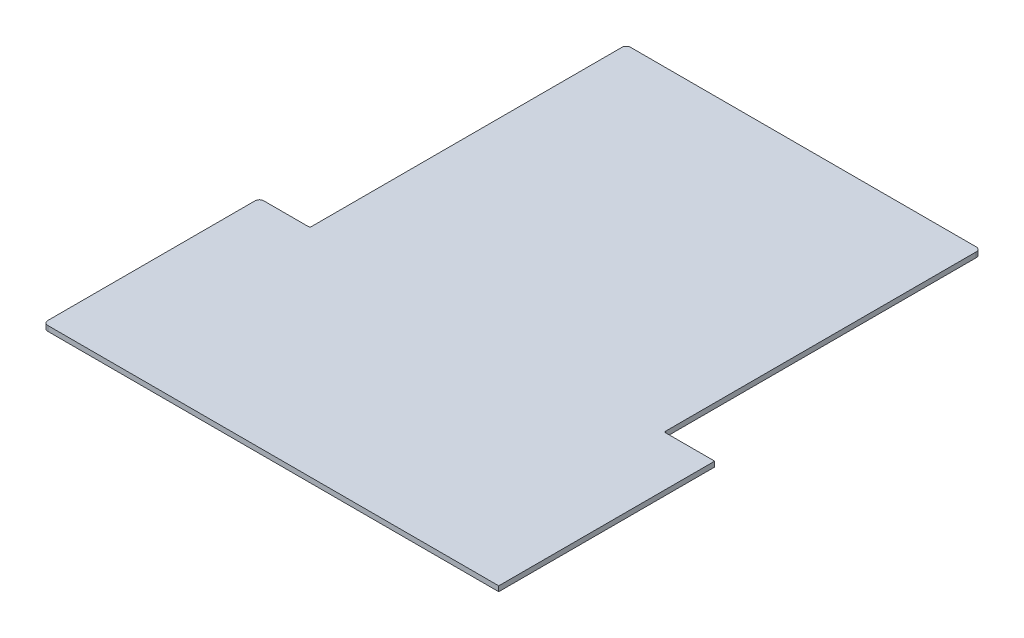
ISO-10303-21;
HEADER;
FILE_DESCRIPTION(('STEP AP214'),'2;1');
FILE_NAME('part.step','',(''),(''),'','','');
FILE_SCHEMA(('AUTOMOTIVE_DESIGN { 1 0 10303 214 1 1 1 1 }'));
ENDSEC;
DATA;
#1=APPLICATION_CONTEXT('core data for automotive mechanical design processes');
#2=APPLICATION_PROTOCOL_DEFINITION('international standard','automotive_design',2000,#1);
#3=PRODUCT_CONTEXT('',#1,'mechanical');
#4=PRODUCT('Part','Part','',(#3));
#5=PRODUCT_RELATED_PRODUCT_CATEGORY('part','',(#4));
#6=PRODUCT_DEFINITION_FORMATION('','',#4);
#7=PRODUCT_DEFINITION_CONTEXT('part definition',#1,'design');
#8=PRODUCT_DEFINITION('design','',#6,#7);
#9=PRODUCT_DEFINITION_SHAPE('','',#8);
#10=(LENGTH_UNIT() NAMED_UNIT(*) SI_UNIT(.MILLI.,.METRE.));
#11=(NAMED_UNIT(*) PLANE_ANGLE_UNIT() SI_UNIT($,.RADIAN.));
#12=(NAMED_UNIT(*) SI_UNIT($,.STERADIAN.) SOLID_ANGLE_UNIT());
#13=UNCERTAINTY_MEASURE_WITH_UNIT(LENGTH_MEASURE(1.E-05),#10,'distance_accuracy_value','');
#14=(GEOMETRIC_REPRESENTATION_CONTEXT(3) GLOBAL_UNCERTAINTY_ASSIGNED_CONTEXT((#13)) GLOBAL_UNIT_ASSIGNED_CONTEXT((#10,
#11,#12)) REPRESENTATION_CONTEXT('',''));
#15=CARTESIAN_POINT('',(0.,0.,0.));
#16=DIRECTION('',(0.,0.,1.));
#17=DIRECTION('',(1.,0.,0.));
#18=AXIS2_PLACEMENT_3D('',#15,#16,#17);
#19=CARTESIAN_POINT('',(-103.5,3.,-155.5));
#20=DIRECTION('',(0.,0.,1.));
#21=DIRECTION('',(1.,0.,0.));
#22=AXIS2_PLACEMENT_3D('',#19,#20,#21);
#23=PLANE('',#22);
#24=DIRECTION('',(-1.,0.,0.));
#25=VECTOR('',#24,1.);
#26=CARTESIAN_POINT('',(-103.5,0.,-155.5));
#27=LINE('',#26,#25);
#28=CARTESIAN_POINT('',(101.,0.,-155.5));
#29=VERTEX_POINT('',#28);
#30=CARTESIAN_POINT('',(-101.,0.,-155.5));
#31=VERTEX_POINT('',#30);
#32=EDGE_CURVE('E172',#29,#31,#27,.T.);
#33=ORIENTED_EDGE('',*,*,#32,.T.);
#34=DIRECTION('',(0.,-1.,0.));
#35=VECTOR('',#34,1.);
#36=CARTESIAN_POINT('',(-101.,3.,-155.5));
#37=LINE('',#36,#35);
#38=CARTESIAN_POINT('',(-101.,3.,-155.5));
#39=VERTEX_POINT('',#38);
#40=EDGE_CURVE('E224',#31,#39,#37,.F.);
#41=ORIENTED_EDGE('',*,*,#40,.T.);
#42=DIRECTION('',(-1.,0.,0.));
#43=VECTOR('',#42,1.);
#44=CARTESIAN_POINT('',(-103.5,3.,-155.5));
#45=LINE('',#44,#43);
#46=CARTESIAN_POINT('',(101.,3.,-155.5));
#47=VERTEX_POINT('',#46);
#48=EDGE_CURVE('E190',#47,#39,#45,.T.);
#49=ORIENTED_EDGE('',*,*,#48,.F.);
#50=DIRECTION('',(0.,-1.,0.));
#51=VECTOR('',#50,1.);
#52=CARTESIAN_POINT('',(101.,3.,-155.5));
#53=LINE('',#52,#51);
#54=EDGE_CURVE('E221',#47,#29,#53,.T.);
#55=ORIENTED_EDGE('',*,*,#54,.T.);
#56=EDGE_LOOP('',(#33,#41,#49,#55));
#57=FACE_BOUND('',#56,.T.);
#58=ADVANCED_FACE('F39',(#57),#23,.F.);
#59=CARTESIAN_POINT('',(-103.5,3.,29.3273000000001));
#60=DIRECTION('',(1.,0.,0.));
#61=DIRECTION('',(0.,0.,-1.));
#62=AXIS2_PLACEMENT_3D('',#59,#60,#61);
#63=PLANE('',#62);
#64=DIRECTION('',(0.,0.,1.));
#65=VECTOR('',#64,1.);
#66=CARTESIAN_POINT('',(-103.5,0.,29.3273000000001));
#67=LINE('',#66,#65);
#68=CARTESIAN_POINT('',(-103.5,0.,-153.));
#69=VERTEX_POINT('',#68);
#70=CARTESIAN_POINT('',(-103.5,0.,28.3273000000001));
#71=VERTEX_POINT('',#70);
#72=EDGE_CURVE('E175',#69,#71,#67,.T.);
#73=ORIENTED_EDGE('',*,*,#72,.T.);
#74=DIRECTION('',(0.,-1.,0.));
#75=VECTOR('',#74,1.);
#76=CARTESIAN_POINT('',(-103.5,3.,28.3273000000001));
#77=LINE('',#76,#75);
#78=CARTESIAN_POINT('',(-103.5,3.,28.3273000000001));
#79=VERTEX_POINT('',#78);
#80=EDGE_CURVE('E232',#71,#79,#77,.F.);
#81=ORIENTED_EDGE('',*,*,#80,.T.);
#82=DIRECTION('',(0.,0.,1.));
#83=VECTOR('',#82,1.);
#84=CARTESIAN_POINT('',(-103.5,3.,29.3273000000001));
#85=LINE('',#84,#83);
#86=CARTESIAN_POINT('',(-103.5,3.,-153.));
#87=VERTEX_POINT('',#86);
#88=EDGE_CURVE('E246',#87,#79,#85,.T.);
#89=ORIENTED_EDGE('',*,*,#88,.F.);
#90=DIRECTION('',(0.,-1.,0.));
#91=VECTOR('',#90,1.);
#92=CARTESIAN_POINT('',(-103.5,3.,-153.));
#93=LINE('',#92,#91);
#94=EDGE_CURVE('E218',#87,#69,#93,.T.);
#95=ORIENTED_EDGE('',*,*,#94,.T.);
#96=EDGE_LOOP('',(#73,#81,#89,#95));
#97=FACE_BOUND('',#96,.T.);
#98=ADVANCED_FACE('F260',(#97),#63,.F.);
#99=CARTESIAN_POINT('',(-133.,3.,29.3273000000001));
#100=DIRECTION('',(0.,0.,1.));
#101=DIRECTION('',(1.,0.,0.));
#102=AXIS2_PLACEMENT_3D('',#99,#100,#101);
#103=PLANE('',#102);
#104=DIRECTION('',(-1.,0.,0.));
#105=VECTOR('',#104,1.);
#106=CARTESIAN_POINT('',(-133.,3.,29.3273000000001));
#107=LINE('',#106,#105);
#108=CARTESIAN_POINT('',(-104.5,3.,29.3273000000001));
#109=VERTEX_POINT('',#108);
#110=CARTESIAN_POINT('',(-130.5,3.,29.3273000000001));
#111=VERTEX_POINT('',#110);
#112=EDGE_CURVE('E244',#109,#111,#107,.T.);
#113=ORIENTED_EDGE('',*,*,#112,.F.);
#114=DIRECTION('',(0.,-1.,0.));
#115=VECTOR('',#114,1.);
#116=CARTESIAN_POINT('',(-104.5,0.,29.3273000000001));
#117=LINE('',#116,#115);
#118=CARTESIAN_POINT('',(-104.5,0.,29.3273000000001));
#119=VERTEX_POINT('',#118);
#120=EDGE_CURVE('E229',#109,#119,#117,.T.);
#121=ORIENTED_EDGE('',*,*,#120,.T.);
#122=DIRECTION('',(-1.,0.,0.));
#123=VECTOR('',#122,1.);
#124=CARTESIAN_POINT('',(-133.,0.,29.3273000000001));
#125=LINE('',#124,#123);
#126=CARTESIAN_POINT('',(-130.5,0.,29.3273000000001));
#127=VERTEX_POINT('',#126);
#128=EDGE_CURVE('E178',#119,#127,#125,.T.);
#129=ORIENTED_EDGE('',*,*,#128,.T.);
#130=DIRECTION('',(0.,-1.,0.));
#131=VECTOR('',#130,1.);
#132=CARTESIAN_POINT('',(-130.5,3.,29.3273000000001));
#133=LINE('',#132,#131);
#134=EDGE_CURVE('E215',#127,#111,#133,.F.);
#135=ORIENTED_EDGE('',*,*,#134,.T.);
#136=EDGE_LOOP('',(#113,#121,#129,#135));
#137=FACE_BOUND('',#136,.T.);
#138=ADVANCED_FACE('F251',(#137),#103,.F.);
#139=CARTESIAN_POINT('',(-133.,3.,155.5));
#140=DIRECTION('',(1.,0.,0.));
#141=DIRECTION('',(0.,0.,-1.));
#142=AXIS2_PLACEMENT_3D('',#139,#140,#141);
#143=PLANE('',#142);
#144=DIRECTION('',(0.,0.,1.));
#145=VECTOR('',#144,1.);
#146=CARTESIAN_POINT('',(-133.,0.,155.5));
#147=LINE('',#146,#145);
#148=CARTESIAN_POINT('',(-133.,0.,31.8273000000001));
#149=VERTEX_POINT('',#148);
#150=CARTESIAN_POINT('',(-133.,0.,153.));
#151=VERTEX_POINT('',#150);
#152=EDGE_CURVE('E180',#149,#151,#147,.T.);
#153=ORIENTED_EDGE('',*,*,#152,.T.);
#154=DIRECTION('',(0.,-1.,0.));
#155=VECTOR('',#154,1.);
#156=CARTESIAN_POINT('',(-133.,3.,153.));
#157=LINE('',#156,#155);
#158=CARTESIAN_POINT('',(-133.,3.,153.));
#159=VERTEX_POINT('',#158);
#160=EDGE_CURVE('E206',#151,#159,#157,.F.);
#161=ORIENTED_EDGE('',*,*,#160,.T.);
#162=DIRECTION('',(0.,0.,1.));
#163=VECTOR('',#162,1.);
#164=CARTESIAN_POINT('',(-133.,3.,155.5));
#165=LINE('',#164,#163);
#166=CARTESIAN_POINT('',(-133.,3.,31.8273000000001));
#167=VERTEX_POINT('',#166);
#168=EDGE_CURVE('E151',#167,#159,#165,.T.);
#169=ORIENTED_EDGE('',*,*,#168,.F.);
#170=DIRECTION('',(0.,-1.,0.));
#171=VECTOR('',#170,1.);
#172=CARTESIAN_POINT('',(-133.,3.,31.8273000000001));
#173=LINE('',#172,#171);
#174=EDGE_CURVE('E203',#167,#149,#173,.T.);
#175=ORIENTED_EDGE('',*,*,#174,.T.);
#176=EDGE_LOOP('',(#153,#161,#169,#175));
#177=FACE_BOUND('',#176,.T.);
#178=ADVANCED_FACE('F286',(#177),#143,.F.);
#179=CARTESIAN_POINT('',(133.,3.,155.5));
#180=DIRECTION('',(0.,0.,-1.));
#181=DIRECTION('',(-1.,0.,0.));
#182=AXIS2_PLACEMENT_3D('',#179,#180,#181);
#183=PLANE('',#182);
#184=DIRECTION('',(1.,0.,0.));
#185=VECTOR('',#184,1.);
#186=CARTESIAN_POINT('',(133.,3.,155.5));
#187=LINE('',#186,#185);
#188=CARTESIAN_POINT('',(-130.5,3.,155.5));
#189=VERTEX_POINT('',#188);
#190=CARTESIAN_POINT('',(133.,3.,155.5));
#191=VERTEX_POINT('',#190);
#192=EDGE_CURVE('E139',#189,#191,#187,.T.);
#193=ORIENTED_EDGE('',*,*,#192,.F.);
#194=DIRECTION('',(0.,-1.,0.));
#195=VECTOR('',#194,1.);
#196=CARTESIAN_POINT('',(-130.5,3.,155.5));
#197=LINE('',#196,#195);
#198=CARTESIAN_POINT('',(-130.5,0.,155.5));
#199=VERTEX_POINT('',#198);
#200=EDGE_CURVE('E160',#189,#199,#197,.T.);
#201=ORIENTED_EDGE('',*,*,#200,.T.);
#202=DIRECTION('',(1.,0.,0.));
#203=VECTOR('',#202,1.);
#204=CARTESIAN_POINT('',(133.,0.,155.5));
#205=LINE('',#204,#203);
#206=CARTESIAN_POINT('',(133.,0.,155.5));
#207=VERTEX_POINT('',#206);
#208=EDGE_CURVE('E157',#199,#207,#205,.T.);
#209=ORIENTED_EDGE('',*,*,#208,.T.);
#210=DIRECTION('',(0.,-1.,0.));
#211=VECTOR('',#210,1.);
#212=CARTESIAN_POINT('',(133.,3.,155.5));
#213=LINE('',#212,#211);
#214=EDGE_CURVE('E154',#191,#207,#213,.T.);
#215=ORIENTED_EDGE('',*,*,#214,.F.);
#216=EDGE_LOOP('',(#193,#201,#209,#215));
#217=FACE_BOUND('',#216,.T.);
#218=ADVANCED_FACE('F155',(#217),#183,.F.);
#219=CARTESIAN_POINT('',(133.,3.,29.3273));
#220=DIRECTION('',(-1.,0.,0.));
#221=DIRECTION('',(0.,0.,1.));
#222=AXIS2_PLACEMENT_3D('',#219,#220,#221);
#223=PLANE('',#222);
#224=DIRECTION('',(0.,0.,-1.));
#225=VECTOR('',#224,1.);
#226=CARTESIAN_POINT('',(133.,0.,29.3273));
#227=LINE('',#226,#225);
#228=CARTESIAN_POINT('',(133.,0.,29.3273));
#229=VERTEX_POINT('',#228);
#230=EDGE_CURVE('E184',#207,#229,#227,.T.);
#231=ORIENTED_EDGE('',*,*,#230,.T.);
#232=DIRECTION('',(0.,-1.,0.));
#233=VECTOR('',#232,1.);
#234=CARTESIAN_POINT('',(133.,3.,29.3273));
#235=LINE('',#234,#233);
#236=CARTESIAN_POINT('',(133.,3.,29.3273));
#237=VERTEX_POINT('',#236);
#238=EDGE_CURVE('E161',#237,#229,#235,.T.);
#239=ORIENTED_EDGE('',*,*,#238,.F.);
#240=DIRECTION('',(0.,0.,-1.));
#241=VECTOR('',#240,1.);
#242=CARTESIAN_POINT('',(133.,3.,29.3273));
#243=LINE('',#242,#241);
#244=EDGE_CURVE('E144',#191,#237,#243,.T.);
#245=ORIENTED_EDGE('',*,*,#244,.F.);
#246=ORIENTED_EDGE('',*,*,#214,.T.);
#247=EDGE_LOOP('',(#231,#239,#245,#246));
#248=FACE_BOUND('',#247,.T.);
#249=ADVANCED_FACE('F163',(#248),#223,.F.);
#250=CARTESIAN_POINT('',(103.5,3.,29.3273));
#251=DIRECTION('',(0.,0.,1.));
#252=DIRECTION('',(1.,0.,0.));
#253=AXIS2_PLACEMENT_3D('',#250,#251,#252);
#254=PLANE('',#253);
#255=DIRECTION('',(-1.,0.,0.));
#256=VECTOR('',#255,1.);
#257=CARTESIAN_POINT('',(103.5,0.,29.3273));
#258=LINE('',#257,#256);
#259=CARTESIAN_POINT('',(104.5,0.,29.3273));
#260=VERTEX_POINT('',#259);
#261=EDGE_CURVE('E186',#229,#260,#258,.T.);
#262=ORIENTED_EDGE('',*,*,#261,.T.);
#263=DIRECTION('',(0.,-1.,0.));
#264=VECTOR('',#263,1.);
#265=CARTESIAN_POINT('',(104.5,3.,29.3273));
#266=LINE('',#265,#264);
#267=CARTESIAN_POINT('',(104.5,3.,29.3273));
#268=VERTEX_POINT('',#267);
#269=EDGE_CURVE('E54',#260,#268,#266,.F.);
#270=ORIENTED_EDGE('',*,*,#269,.T.);
#271=DIRECTION('',(-1.,0.,0.));
#272=VECTOR('',#271,1.);
#273=CARTESIAN_POINT('',(103.5,3.,29.3273));
#274=LINE('',#273,#272);
#275=EDGE_CURVE('E165',#237,#268,#274,.T.);
#276=ORIENTED_EDGE('',*,*,#275,.F.);
#277=ORIENTED_EDGE('',*,*,#238,.T.);
#278=EDGE_LOOP('',(#262,#270,#276,#277));
#279=FACE_BOUND('',#278,.T.);
#280=ADVANCED_FACE('F281',(#279),#254,.F.);
#281=CARTESIAN_POINT('',(103.5,3.,-155.5));
#282=DIRECTION('',(-1.,0.,0.));
#283=DIRECTION('',(0.,0.,1.));
#284=AXIS2_PLACEMENT_3D('',#281,#282,#283);
#285=PLANE('',#284);
#286=DIRECTION('',(0.,0.,-1.));
#287=VECTOR('',#286,1.);
#288=CARTESIAN_POINT('',(103.5,3.,-155.5));
#289=LINE('',#288,#287);
#290=CARTESIAN_POINT('',(103.5,3.,28.3273));
#291=VERTEX_POINT('',#290);
#292=CARTESIAN_POINT('',(103.5,3.,-153.));
#293=VERTEX_POINT('',#292);
#294=EDGE_CURVE('E167',#291,#293,#289,.T.);
#295=ORIENTED_EDGE('',*,*,#294,.F.);
#296=DIRECTION('',(0.,-1.,0.));
#297=VECTOR('',#296,1.);
#298=CARTESIAN_POINT('',(103.5,0.,28.3273));
#299=LINE('',#298,#297);
#300=CARTESIAN_POINT('',(103.5,0.,28.3273));
#301=VERTEX_POINT('',#300);
#302=EDGE_CURVE('E234',#291,#301,#299,.T.);
#303=ORIENTED_EDGE('',*,*,#302,.T.);
#304=DIRECTION('',(0.,0.,-1.));
#305=VECTOR('',#304,1.);
#306=CARTESIAN_POINT('',(103.5,0.,-155.5));
#307=LINE('',#306,#305);
#308=CARTESIAN_POINT('',(103.5,0.,-153.));
#309=VERTEX_POINT('',#308);
#310=EDGE_CURVE('E188',#301,#309,#307,.T.);
#311=ORIENTED_EDGE('',*,*,#310,.T.);
#312=DIRECTION('',(0.,-1.,0.));
#313=VECTOR('',#312,1.);
#314=CARTESIAN_POINT('',(103.5,3.,-153.));
#315=LINE('',#314,#313);
#316=EDGE_CURVE('E226',#309,#293,#315,.F.);
#317=ORIENTED_EDGE('',*,*,#316,.T.);
#318=EDGE_LOOP('',(#295,#303,#311,#317));
#319=FACE_BOUND('',#318,.T.);
#320=ADVANCED_FACE('F277',(#319),#285,.F.);
#321=CARTESIAN_POINT('',(0.,3.,0.));
#322=DIRECTION('',(0.,-1.,0.));
#323=DIRECTION('',(0.,0.,-1.));
#324=AXIS2_PLACEMENT_3D('',#321,#322,#323);
#325=PLANE('',#324);
#326=ORIENTED_EDGE('',*,*,#168,.T.);
#327=CARTESIAN_POINT('',(-130.5,3.,153.));
#328=DIRECTION('',(0.,-1.,0.));
#329=DIRECTION('',(0.,0.,-1.));
#330=AXIS2_PLACEMENT_3D('',#327,#328,#329);
#331=CIRCLE('',#330,2.5);
#332=EDGE_CURVE('E147',#159,#189,#331,.F.);
#333=ORIENTED_EDGE('',*,*,#332,.T.);
#334=ORIENTED_EDGE('',*,*,#192,.T.);
#335=ORIENTED_EDGE('',*,*,#244,.T.);
#336=ORIENTED_EDGE('',*,*,#275,.T.);
#337=CARTESIAN_POINT('',(104.5,3.,28.3273));
#338=DIRECTION('',(0.,-1.,0.));
#339=DIRECTION('',(0.,0.,-1.));
#340=AXIS2_PLACEMENT_3D('',#337,#338,#339);
#341=CIRCLE('',#340,1.);
#342=EDGE_CURVE('E11',#268,#291,#341,.T.);
#343=ORIENTED_EDGE('',*,*,#342,.T.);
#344=ORIENTED_EDGE('',*,*,#294,.T.);
#345=CARTESIAN_POINT('',(101.,3.,-153.));
#346=DIRECTION('',(0.,-1.,0.));
#347=DIRECTION('',(0.,0.,-1.));
#348=AXIS2_PLACEMENT_3D('',#345,#346,#347);
#349=CIRCLE('',#348,2.5);
#350=EDGE_CURVE('E208',#293,#47,#349,.F.);
#351=ORIENTED_EDGE('',*,*,#350,.T.);
#352=ORIENTED_EDGE('',*,*,#48,.T.);
#353=CARTESIAN_POINT('',(-101.,3.,-153.));
#354=DIRECTION('',(0.,-1.,0.));
#355=DIRECTION('',(0.,0.,-1.));
#356=AXIS2_PLACEMENT_3D('',#353,#354,#355);
#357=CIRCLE('',#356,2.5);
#358=EDGE_CURVE('E210',#39,#87,#357,.F.);
#359=ORIENTED_EDGE('',*,*,#358,.T.);
#360=ORIENTED_EDGE('',*,*,#88,.T.);
#361=CARTESIAN_POINT('',(-104.5,3.,28.3273000000001));
#362=DIRECTION('',(0.,-1.,0.));
#363=DIRECTION('',(0.,0.,-1.));
#364=AXIS2_PLACEMENT_3D('',#361,#362,#363);
#365=CIRCLE('',#364,1.);
#366=EDGE_CURVE('E240',#79,#109,#365,.T.);
#367=ORIENTED_EDGE('',*,*,#366,.T.);
#368=ORIENTED_EDGE('',*,*,#112,.T.);
#369=CARTESIAN_POINT('',(-130.5,3.,31.8273000000001));
#370=DIRECTION('',(0.,-1.,0.));
#371=DIRECTION('',(0.,0.,-1.));
#372=AXIS2_PLACEMENT_3D('',#369,#370,#371);
#373=CIRCLE('',#372,2.5);
#374=EDGE_CURVE('E212',#111,#167,#373,.F.);
#375=ORIENTED_EDGE('',*,*,#374,.T.);
#376=EDGE_LOOP('',(#326,#333,#334,#335,#336,#343,#344,#351,#352,#359,#360,#367,#368,#375));
#377=FACE_BOUND('',#376,.T.);
#378=ADVANCED_FACE('F142',(#377),#325,.F.);
#379=CARTESIAN_POINT('',(0.,0.,0.));
#380=DIRECTION('',(0.,-1.,0.));
#381=DIRECTION('',(0.,0.,-1.));
#382=AXIS2_PLACEMENT_3D('',#379,#380,#381);
#383=PLANE('',#382);
#384=ORIENTED_EDGE('',*,*,#208,.F.);
#385=CARTESIAN_POINT('',(-130.5,0.,153.));
#386=DIRECTION('',(0.,-1.,0.));
#387=DIRECTION('',(0.,0.,-1.));
#388=AXIS2_PLACEMENT_3D('',#385,#386,#387);
#389=CIRCLE('',#388,2.5);
#390=EDGE_CURVE('E201',#199,#151,#389,.T.);
#391=ORIENTED_EDGE('',*,*,#390,.T.);
#392=ORIENTED_EDGE('',*,*,#152,.F.);
#393=CARTESIAN_POINT('',(-130.5,0.,31.8273000000001));
#394=DIRECTION('',(0.,-1.,0.));
#395=DIRECTION('',(0.,0.,-1.));
#396=AXIS2_PLACEMENT_3D('',#393,#394,#395);
#397=CIRCLE('',#396,2.5);
#398=EDGE_CURVE('E198',#149,#127,#397,.T.);
#399=ORIENTED_EDGE('',*,*,#398,.T.);
#400=ORIENTED_EDGE('',*,*,#128,.F.);
#401=CARTESIAN_POINT('',(-104.5,0.,28.3273000000001));
#402=DIRECTION('',(0.,-1.,0.));
#403=DIRECTION('',(0.,0.,-1.));
#404=AXIS2_PLACEMENT_3D('',#401,#402,#403);
#405=CIRCLE('',#404,1.);
#406=EDGE_CURVE('E238',#119,#71,#405,.F.);
#407=ORIENTED_EDGE('',*,*,#406,.T.);
#408=ORIENTED_EDGE('',*,*,#72,.F.);
#409=CARTESIAN_POINT('',(-101.,0.,-153.));
#410=DIRECTION('',(0.,-1.,0.));
#411=DIRECTION('',(0.,0.,-1.));
#412=AXIS2_PLACEMENT_3D('',#409,#410,#411);
#413=CIRCLE('',#412,2.5);
#414=EDGE_CURVE('E196',#69,#31,#413,.T.);
#415=ORIENTED_EDGE('',*,*,#414,.T.);
#416=ORIENTED_EDGE('',*,*,#32,.F.);
#417=CARTESIAN_POINT('',(101.,0.,-153.));
#418=DIRECTION('',(0.,-1.,0.));
#419=DIRECTION('',(0.,0.,-1.));
#420=AXIS2_PLACEMENT_3D('',#417,#418,#419);
#421=CIRCLE('',#420,2.5);
#422=EDGE_CURVE('E193',#29,#309,#421,.T.);
#423=ORIENTED_EDGE('',*,*,#422,.T.);
#424=ORIENTED_EDGE('',*,*,#310,.F.);
#425=CARTESIAN_POINT('',(104.5,0.,28.3273));
#426=DIRECTION('',(0.,-1.,0.));
#427=DIRECTION('',(0.,0.,-1.));
#428=AXIS2_PLACEMENT_3D('',#425,#426,#427);
#429=CIRCLE('',#428,1.);
#430=EDGE_CURVE('E47',#301,#260,#429,.F.);
#431=ORIENTED_EDGE('',*,*,#430,.T.);
#432=ORIENTED_EDGE('',*,*,#261,.F.);
#433=ORIENTED_EDGE('',*,*,#230,.F.);
#434=EDGE_LOOP('',(#384,#391,#392,#399,#400,#407,#408,#415,#416,#423,#424,#431,#432,#433));
#435=FACE_BOUND('',#434,.T.);
#436=ADVANCED_FACE('F258',(#435),#383,.T.);
#437=CARTESIAN_POINT('',(-130.5,3.,153.));
#438=DIRECTION('',(0.,-1.,0.));
#439=DIRECTION('',(0.,0.,-1.));
#440=AXIS2_PLACEMENT_3D('',#437,#438,#439);
#441=CYLINDRICAL_SURFACE('',#440,2.5);
#442=ORIENTED_EDGE('',*,*,#332,.F.);
#443=ORIENTED_EDGE('',*,*,#160,.F.);
#444=ORIENTED_EDGE('',*,*,#390,.F.);
#445=ORIENTED_EDGE('',*,*,#200,.F.);
#446=EDGE_LOOP('',(#442,#443,#444,#445));
#447=FACE_BOUND('',#446,.T.);
#448=ADVANCED_FACE('F289',(#447),#441,.T.);
#449=CARTESIAN_POINT('',(-130.5,3.,31.8273000000001));
#450=DIRECTION('',(0.,-1.,0.));
#451=DIRECTION('',(0.,0.,-1.));
#452=AXIS2_PLACEMENT_3D('',#449,#450,#451);
#453=CYLINDRICAL_SURFACE('',#452,2.5);
#454=ORIENTED_EDGE('',*,*,#374,.F.);
#455=ORIENTED_EDGE('',*,*,#134,.F.);
#456=ORIENTED_EDGE('',*,*,#398,.F.);
#457=ORIENTED_EDGE('',*,*,#174,.F.);
#458=EDGE_LOOP('',(#454,#455,#456,#457));
#459=FACE_BOUND('',#458,.T.);
#460=ADVANCED_FACE('F291',(#459),#453,.T.);
#461=CARTESIAN_POINT('',(-101.,3.,-153.));
#462=DIRECTION('',(0.,-1.,0.));
#463=DIRECTION('',(0.,0.,-1.));
#464=AXIS2_PLACEMENT_3D('',#461,#462,#463);
#465=CYLINDRICAL_SURFACE('',#464,2.5);
#466=ORIENTED_EDGE('',*,*,#358,.F.);
#467=ORIENTED_EDGE('',*,*,#40,.F.);
#468=ORIENTED_EDGE('',*,*,#414,.F.);
#469=ORIENTED_EDGE('',*,*,#94,.F.);
#470=EDGE_LOOP('',(#466,#467,#468,#469));
#471=FACE_BOUND('',#470,.T.);
#472=ADVANCED_FACE('F264',(#471),#465,.T.);
#473=CARTESIAN_POINT('',(101.,3.,-153.));
#474=DIRECTION('',(0.,-1.,0.));
#475=DIRECTION('',(0.,0.,-1.));
#476=AXIS2_PLACEMENT_3D('',#473,#474,#475);
#477=CYLINDRICAL_SURFACE('',#476,2.5);
#478=ORIENTED_EDGE('',*,*,#350,.F.);
#479=ORIENTED_EDGE('',*,*,#316,.F.);
#480=ORIENTED_EDGE('',*,*,#422,.F.);
#481=ORIENTED_EDGE('',*,*,#54,.F.);
#482=EDGE_LOOP('',(#478,#479,#480,#481));
#483=FACE_BOUND('',#482,.T.);
#484=ADVANCED_FACE('F273',(#483),#477,.T.);
#485=CARTESIAN_POINT('',(-104.5,3.,28.3273000000001));
#486=DIRECTION('',(0.,1.,0.));
#487=DIRECTION('',(0.,0.,1.));
#488=AXIS2_PLACEMENT_3D('',#485,#486,#487);
#489=CYLINDRICAL_SURFACE('',#488,1.);
#490=ORIENTED_EDGE('',*,*,#366,.F.);
#491=ORIENTED_EDGE('',*,*,#80,.F.);
#492=ORIENTED_EDGE('',*,*,#406,.F.);
#493=ORIENTED_EDGE('',*,*,#120,.F.);
#494=EDGE_LOOP('',(#490,#491,#492,#493));
#495=FACE_BOUND('',#494,.T.);
#496=ADVANCED_FACE('F256',(#495),#489,.F.);
#497=CARTESIAN_POINT('',(104.5,3.,28.3273));
#498=DIRECTION('',(0.,1.,0.));
#499=DIRECTION('',(0.,0.,1.));
#500=AXIS2_PLACEMENT_3D('',#497,#498,#499);
#501=CYLINDRICAL_SURFACE('',#500,1.);
#502=ORIENTED_EDGE('',*,*,#342,.F.);
#503=ORIENTED_EDGE('',*,*,#269,.F.);
#504=ORIENTED_EDGE('',*,*,#430,.F.);
#505=ORIENTED_EDGE('',*,*,#302,.F.);
#506=EDGE_LOOP('',(#502,#503,#504,#505));
#507=FACE_BOUND('',#506,.T.);
#508=ADVANCED_FACE('F41',(#507),#501,.F.);
#509=CLOSED_SHELL('',(#58,#98,#138,#178,#218,#249,#280,#320,#378,#436,#448,#460,#472,#484,#496,#508));
#510=MANIFOLD_SOLID_BREP('B2',#509);
#511=ADVANCED_BREP_SHAPE_REPRESENTATION('',(#18,#510),#14);
#512=SHAPE_DEFINITION_REPRESENTATION(#9,#511);
ENDSEC;
END-ISO-10303-21;
